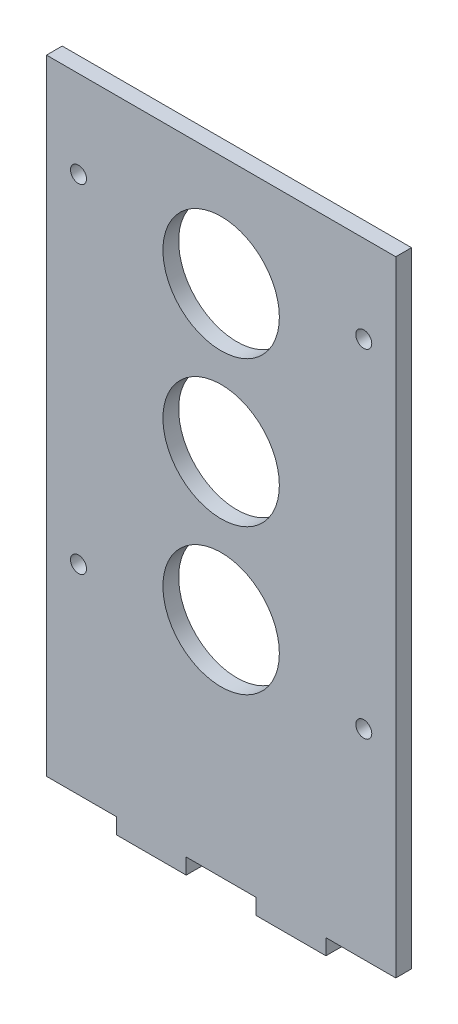
ISO-10303-21;
HEADER;
FILE_DESCRIPTION(('STEP AP214'),'2;1');
FILE_NAME('part.step','',(''),(''),'','','');
FILE_SCHEMA(('AUTOMOTIVE_DESIGN { 1 0 10303 214 1 1 1 1 }'));
ENDSEC;
DATA;
#1=APPLICATION_CONTEXT('core data for automotive mechanical design processes');
#2=APPLICATION_PROTOCOL_DEFINITION('international standard','automotive_design',2000,#1);
#3=PRODUCT_CONTEXT('',#1,'mechanical');
#4=PRODUCT('Part','Part','',(#3));
#5=PRODUCT_RELATED_PRODUCT_CATEGORY('part','',(#4));
#6=PRODUCT_DEFINITION_FORMATION('','',#4);
#7=PRODUCT_DEFINITION_CONTEXT('part definition',#1,'design');
#8=PRODUCT_DEFINITION('design','',#6,#7);
#9=PRODUCT_DEFINITION_SHAPE('','',#8);
#10=(LENGTH_UNIT() NAMED_UNIT(*) SI_UNIT(.MILLI.,.METRE.));
#11=(NAMED_UNIT(*) PLANE_ANGLE_UNIT() SI_UNIT($,.RADIAN.));
#12=(NAMED_UNIT(*) SI_UNIT($,.STERADIAN.) SOLID_ANGLE_UNIT());
#13=UNCERTAINTY_MEASURE_WITH_UNIT(LENGTH_MEASURE(1.E-05),#10,'distance_accuracy_value','');
#14=(GEOMETRIC_REPRESENTATION_CONTEXT(3) GLOBAL_UNCERTAINTY_ASSIGNED_CONTEXT((#13)) GLOBAL_UNIT_ASSIGNED_CONTEXT((#10,
#11,#12)) REPRESENTATION_CONTEXT('',''));
#15=CARTESIAN_POINT('',(0.,0.,0.));
#16=DIRECTION('',(0.,0.,1.));
#17=DIRECTION('',(1.,0.,0.));
#18=AXIS2_PLACEMENT_3D('',#15,#16,#17);
#19=CARTESIAN_POINT('',(0.,0.,2.7));
#20=DIRECTION('',(0.,0.,-1.));
#21=DIRECTION('',(-1.,0.,0.));
#22=AXIS2_PLACEMENT_3D('',#19,#20,#21);
#23=PLANE('',#22);
#24=DIRECTION('',(0.,-1.,0.));
#25=VECTOR('',#24,1.);
#26=CARTESIAN_POINT('',(-30.,50.,2.7));
#27=LINE('',#26,#25);
#28=CARTESIAN_POINT('',(-30.,60.,2.7));
#29=VERTEX_POINT('',#28);
#30=CARTESIAN_POINT('',(-30.,-47.3,2.7));
#31=VERTEX_POINT('',#30);
#32=EDGE_CURVE('E103',#29,#31,#27,.T.);
#33=ORIENTED_EDGE('',*,*,#32,.T.);
#34=DIRECTION('',(1.,0.,0.));
#35=VECTOR('',#34,1.);
#36=CARTESIAN_POINT('',(-18.,-47.3,2.7));
#37=LINE('',#36,#35);
#38=CARTESIAN_POINT('',(-18.,-47.3,2.7));
#39=VERTEX_POINT('',#38);
#40=EDGE_CURVE('E245',#31,#39,#37,.T.);
#41=ORIENTED_EDGE('',*,*,#40,.T.);
#42=DIRECTION('',(0.,-1.,0.));
#43=VECTOR('',#42,1.);
#44=CARTESIAN_POINT('',(-18.,-50.,2.7));
#45=LINE('',#44,#43);
#46=CARTESIAN_POINT('',(-18.,-50.,2.7));
#47=VERTEX_POINT('',#46);
#48=EDGE_CURVE('E204',#39,#47,#45,.T.);
#49=ORIENTED_EDGE('',*,*,#48,.T.);
#50=DIRECTION('',(1.,0.,0.));
#51=VECTOR('',#50,1.);
#52=CARTESIAN_POINT('',(-6.,-50.,2.7));
#53=LINE('',#52,#51);
#54=CARTESIAN_POINT('',(-6.,-50.,2.7));
#55=VERTEX_POINT('',#54);
#56=EDGE_CURVE('E223',#47,#55,#53,.T.);
#57=ORIENTED_EDGE('',*,*,#56,.T.);
#58=DIRECTION('',(0.,1.,0.));
#59=VECTOR('',#58,1.);
#60=CARTESIAN_POINT('',(-6.,-50.,2.7));
#61=LINE('',#60,#59);
#62=CARTESIAN_POINT('',(-6.,-47.3,2.7));
#63=VERTEX_POINT('',#62);
#64=EDGE_CURVE('E220',#55,#63,#61,.T.);
#65=ORIENTED_EDGE('',*,*,#64,.T.);
#66=DIRECTION('',(1.,0.,0.));
#67=VECTOR('',#66,1.);
#68=CARTESIAN_POINT('',(-6.,-47.3,2.7));
#69=LINE('',#68,#67);
#70=CARTESIAN_POINT('',(6.00000000000001,-47.3,2.7));
#71=VERTEX_POINT('',#70);
#72=EDGE_CURVE('E222',#63,#71,#69,.T.);
#73=ORIENTED_EDGE('',*,*,#72,.T.);
#74=DIRECTION('',(0.,-1.,0.));
#75=VECTOR('',#74,1.);
#76=CARTESIAN_POINT('',(6.00000000000001,-50.,2.7));
#77=LINE('',#76,#75);
#78=CARTESIAN_POINT('',(6.00000000000001,-50.,2.7));
#79=VERTEX_POINT('',#78);
#80=EDGE_CURVE('E225',#71,#79,#77,.T.);
#81=ORIENTED_EDGE('',*,*,#80,.T.);
#82=DIRECTION('',(1.,0.,0.));
#83=VECTOR('',#82,1.);
#84=CARTESIAN_POINT('',(18.,-50.,2.7));
#85=LINE('',#84,#83);
#86=CARTESIAN_POINT('',(18.,-50.,2.7));
#87=VERTEX_POINT('',#86);
#88=EDGE_CURVE('E231',#79,#87,#85,.T.);
#89=ORIENTED_EDGE('',*,*,#88,.T.);
#90=DIRECTION('',(0.,1.,0.));
#91=VECTOR('',#90,1.);
#92=CARTESIAN_POINT('',(18.,-50.,2.7));
#93=LINE('',#92,#91);
#94=CARTESIAN_POINT('',(18.,-47.3,2.7));
#95=VERTEX_POINT('',#94);
#96=EDGE_CURVE('E135',#87,#95,#93,.T.);
#97=ORIENTED_EDGE('',*,*,#96,.T.);
#98=DIRECTION('',(1.,0.,0.));
#99=VECTOR('',#98,1.);
#100=CARTESIAN_POINT('',(18.,-47.3,2.7));
#101=LINE('',#100,#99);
#102=CARTESIAN_POINT('',(30.,-47.3,2.7));
#103=VERTEX_POINT('',#102);
#104=EDGE_CURVE('E129',#95,#103,#101,.T.);
#105=ORIENTED_EDGE('',*,*,#104,.T.);
#106=DIRECTION('',(0.,1.,0.));
#107=VECTOR('',#106,1.);
#108=CARTESIAN_POINT('',(30.,-47.3,2.7));
#109=LINE('',#108,#107);
#110=CARTESIAN_POINT('',(30.,60.,2.7));
#111=VERTEX_POINT('',#110);
#112=EDGE_CURVE('E133',#103,#111,#109,.T.);
#113=ORIENTED_EDGE('',*,*,#112,.T.);
#114=DIRECTION('',(-1.,0.,0.));
#115=VECTOR('',#114,1.);
#116=CARTESIAN_POINT('',(-30.,60.,2.7));
#117=LINE('',#116,#115);
#118=EDGE_CURVE('E50',#111,#29,#117,.T.);
#119=ORIENTED_EDGE('',*,*,#118,.T.);
#120=EDGE_LOOP('',(#33,#41,#49,#57,#65,#73,#81,#89,#97,#105,#113,#119));
#121=FACE_BOUND('',#120,.T.);
#122=CARTESIAN_POINT('',(0.,16.,2.7));
#123=DIRECTION('',(0.,0.,1.));
#124=DIRECTION('',(1.,0.,0.));
#125=AXIS2_PLACEMENT_3D('',#122,#123,#124);
#126=CIRCLE('',#125,10.);
#127=CARTESIAN_POINT('',(10.,16.,2.7));
#128=VERTEX_POINT('',#127);
#129=EDGE_CURVE('E156',#128,#128,#126,.T.);
#130=ORIENTED_EDGE('',*,*,#129,.F.);
#131=EDGE_LOOP('',(#130));
#132=FACE_BOUND('',#131,.T.);
#133=CARTESIAN_POINT('',(-24.5,45.,2.7));
#134=DIRECTION('',(0.,0.,1.));
#135=DIRECTION('',(1.,0.,0.));
#136=AXIS2_PLACEMENT_3D('',#133,#134,#135);
#137=CIRCLE('',#136,1.375);
#138=CARTESIAN_POINT('',(-23.125,45.,2.7));
#139=VERTEX_POINT('',#138);
#140=EDGE_CURVE('E479',#139,#139,#137,.T.);
#141=ORIENTED_EDGE('',*,*,#140,.F.);
#142=EDGE_LOOP('',(#141));
#143=FACE_BOUND('',#142,.T.);
#144=CARTESIAN_POINT('',(24.5,45.,2.7));
#145=DIRECTION('',(0.,0.,1.));
#146=DIRECTION('',(1.,0.,0.));
#147=AXIS2_PLACEMENT_3D('',#144,#145,#146);
#148=CIRCLE('',#147,1.375);
#149=CARTESIAN_POINT('',(25.875,45.,2.7));
#150=VERTEX_POINT('',#149);
#151=EDGE_CURVE('E473',#150,#150,#148,.T.);
#152=ORIENTED_EDGE('',*,*,#151,.F.);
#153=EDGE_LOOP('',(#152));
#154=FACE_BOUND('',#153,.T.);
#155=CARTESIAN_POINT('',(-24.5,-13.,2.7));
#156=DIRECTION('',(0.,0.,1.));
#157=DIRECTION('',(1.,0.,0.));
#158=AXIS2_PLACEMENT_3D('',#155,#156,#157);
#159=CIRCLE('',#158,1.375);
#160=CARTESIAN_POINT('',(-23.125,-13.,2.7));
#161=VERTEX_POINT('',#160);
#162=EDGE_CURVE('E467',#161,#161,#159,.T.);
#163=ORIENTED_EDGE('',*,*,#162,.F.);
#164=EDGE_LOOP('',(#163));
#165=FACE_BOUND('',#164,.T.);
#166=CARTESIAN_POINT('',(24.5,-13.,2.7));
#167=DIRECTION('',(0.,0.,1.));
#168=DIRECTION('',(1.,0.,0.));
#169=AXIS2_PLACEMENT_3D('',#166,#167,#168);
#170=CIRCLE('',#169,1.375);
#171=CARTESIAN_POINT('',(25.875,-13.,2.7));
#172=VERTEX_POINT('',#171);
#173=EDGE_CURVE('E461',#172,#172,#170,.T.);
#174=ORIENTED_EDGE('',*,*,#173,.F.);
#175=EDGE_LOOP('',(#174));
#176=FACE_BOUND('',#175,.T.);
#177=CARTESIAN_POINT('',(0.,41.,2.7));
#178=DIRECTION('',(0.,0.,1.));
#179=DIRECTION('',(1.,0.,0.));
#180=AXIS2_PLACEMENT_3D('',#177,#178,#179);
#181=CIRCLE('',#180,10.);
#182=CARTESIAN_POINT('',(10.,41.,2.7));
#183=VERTEX_POINT('',#182);
#184=EDGE_CURVE('E455',#183,#183,#181,.T.);
#185=ORIENTED_EDGE('',*,*,#184,.F.);
#186=EDGE_LOOP('',(#185));
#187=FACE_BOUND('',#186,.T.);
#188=CARTESIAN_POINT('',(0.,-8.99999999999998,2.7));
#189=DIRECTION('',(0.,0.,1.));
#190=DIRECTION('',(1.,0.,0.));
#191=AXIS2_PLACEMENT_3D('',#188,#189,#190);
#192=CIRCLE('',#191,10.);
#193=CARTESIAN_POINT('',(10.,-8.99999999999998,2.7));
#194=VERTEX_POINT('',#193);
#195=EDGE_CURVE('E446',#194,#194,#192,.T.);
#196=ORIENTED_EDGE('',*,*,#195,.F.);
#197=EDGE_LOOP('',(#196));
#198=FACE_BOUND('',#197,.T.);
#199=ADVANCED_FACE('F33',(#121,#132,#143,#154,#165,#176,#187,#198),#23,.F.);
#200=CARTESIAN_POINT('',(0.,0.,0.));
#201=DIRECTION('',(0.,0.,-1.));
#202=DIRECTION('',(-1.,0.,0.));
#203=AXIS2_PLACEMENT_3D('',#200,#201,#202);
#204=PLANE('',#203);
#205=CARTESIAN_POINT('',(0.,41.,0.));
#206=DIRECTION('',(0.,0.,1.));
#207=DIRECTION('',(1.,0.,0.));
#208=AXIS2_PLACEMENT_3D('',#205,#206,#207);
#209=CIRCLE('',#208,10.);
#210=CARTESIAN_POINT('',(10.,41.,0.));
#211=VERTEX_POINT('',#210);
#212=EDGE_CURVE('E452',#211,#211,#209,.T.);
#213=ORIENTED_EDGE('',*,*,#212,.T.);
#214=EDGE_LOOP('',(#213));
#215=FACE_BOUND('',#214,.T.);
#216=CARTESIAN_POINT('',(-24.5,-13.,0.));
#217=DIRECTION('',(0.,0.,1.));
#218=DIRECTION('',(1.,0.,0.));
#219=AXIS2_PLACEMENT_3D('',#216,#217,#218);
#220=CIRCLE('',#219,1.375);
#221=CARTESIAN_POINT('',(-23.125,-13.,0.));
#222=VERTEX_POINT('',#221);
#223=EDGE_CURVE('E464',#222,#222,#220,.T.);
#224=ORIENTED_EDGE('',*,*,#223,.T.);
#225=EDGE_LOOP('',(#224));
#226=FACE_BOUND('',#225,.T.);
#227=CARTESIAN_POINT('',(-24.5,45.,0.));
#228=DIRECTION('',(0.,0.,1.));
#229=DIRECTION('',(1.,0.,0.));
#230=AXIS2_PLACEMENT_3D('',#227,#228,#229);
#231=CIRCLE('',#230,1.375);
#232=CARTESIAN_POINT('',(-23.125,45.,0.));
#233=VERTEX_POINT('',#232);
#234=EDGE_CURVE('E476',#233,#233,#231,.T.);
#235=ORIENTED_EDGE('',*,*,#234,.T.);
#236=EDGE_LOOP('',(#235));
#237=FACE_BOUND('',#236,.T.);
#238=DIRECTION('',(0.,-1.,0.));
#239=VECTOR('',#238,1.);
#240=CARTESIAN_POINT('',(-30.,-47.3,0.));
#241=LINE('',#240,#239);
#242=CARTESIAN_POINT('',(-30.,60.,0.));
#243=VERTEX_POINT('',#242);
#244=CARTESIAN_POINT('',(-30.,-47.3,0.));
#245=VERTEX_POINT('',#244);
#246=EDGE_CURVE('E97',#243,#245,#241,.T.);
#247=ORIENTED_EDGE('',*,*,#246,.F.);
#248=DIRECTION('',(-1.,0.,0.));
#249=VECTOR('',#248,1.);
#250=CARTESIAN_POINT('',(-30.,60.,0.));
#251=LINE('',#250,#249);
#252=CARTESIAN_POINT('',(30.,60.,0.));
#253=VERTEX_POINT('',#252);
#254=EDGE_CURVE('E174',#253,#243,#251,.T.);
#255=ORIENTED_EDGE('',*,*,#254,.F.);
#256=DIRECTION('',(0.,1.,0.));
#257=VECTOR('',#256,1.);
#258=CARTESIAN_POINT('',(30.,60.,0.));
#259=LINE('',#258,#257);
#260=CARTESIAN_POINT('',(30.,-47.3,0.));
#261=VERTEX_POINT('',#260);
#262=EDGE_CURVE('E90',#261,#253,#259,.T.);
#263=ORIENTED_EDGE('',*,*,#262,.F.);
#264=DIRECTION('',(1.,0.,0.));
#265=VECTOR('',#264,1.);
#266=CARTESIAN_POINT('',(18.,-47.3,0.));
#267=LINE('',#266,#265);
#268=CARTESIAN_POINT('',(18.,-47.3,0.));
#269=VERTEX_POINT('',#268);
#270=EDGE_CURVE('E144',#269,#261,#267,.T.);
#271=ORIENTED_EDGE('',*,*,#270,.F.);
#272=DIRECTION('',(0.,1.,0.));
#273=VECTOR('',#272,1.);
#274=CARTESIAN_POINT('',(18.,-50.,0.));
#275=LINE('',#274,#273);
#276=CARTESIAN_POINT('',(18.,-50.,0.));
#277=VERTEX_POINT('',#276);
#278=EDGE_CURVE('E170',#277,#269,#275,.T.);
#279=ORIENTED_EDGE('',*,*,#278,.F.);
#280=DIRECTION('',(1.,0.,0.));
#281=VECTOR('',#280,1.);
#282=CARTESIAN_POINT('',(18.,-50.,0.));
#283=LINE('',#282,#281);
#284=CARTESIAN_POINT('',(6.00000000000001,-50.,0.));
#285=VERTEX_POINT('',#284);
#286=EDGE_CURVE('E168',#285,#277,#283,.T.);
#287=ORIENTED_EDGE('',*,*,#286,.F.);
#288=DIRECTION('',(0.,-1.,0.));
#289=VECTOR('',#288,1.);
#290=CARTESIAN_POINT('',(6.00000000000001,-50.,0.));
#291=LINE('',#290,#289);
#292=CARTESIAN_POINT('',(6.00000000000001,-47.3,0.));
#293=VERTEX_POINT('',#292);
#294=EDGE_CURVE('E166',#293,#285,#291,.T.);
#295=ORIENTED_EDGE('',*,*,#294,.F.);
#296=DIRECTION('',(1.,0.,0.));
#297=VECTOR('',#296,1.);
#298=CARTESIAN_POINT('',(-6.,-47.3,0.));
#299=LINE('',#298,#297);
#300=CARTESIAN_POINT('',(-6.,-47.3,0.));
#301=VERTEX_POINT('',#300);
#302=EDGE_CURVE('E164',#301,#293,#299,.T.);
#303=ORIENTED_EDGE('',*,*,#302,.F.);
#304=DIRECTION('',(0.,1.,0.));
#305=VECTOR('',#304,1.);
#306=CARTESIAN_POINT('',(-6.,-50.,0.));
#307=LINE('',#306,#305);
#308=CARTESIAN_POINT('',(-6.,-50.,0.));
#309=VERTEX_POINT('',#308);
#310=EDGE_CURVE('E162',#309,#301,#307,.T.);
#311=ORIENTED_EDGE('',*,*,#310,.F.);
#312=DIRECTION('',(1.,0.,0.));
#313=VECTOR('',#312,1.);
#314=CARTESIAN_POINT('',(-6.,-50.,0.));
#315=LINE('',#314,#313);
#316=CARTESIAN_POINT('',(-18.,-50.,0.));
#317=VERTEX_POINT('',#316);
#318=EDGE_CURVE('E160',#317,#309,#315,.T.);
#319=ORIENTED_EDGE('',*,*,#318,.F.);
#320=DIRECTION('',(0.,-1.,0.));
#321=VECTOR('',#320,1.);
#322=CARTESIAN_POINT('',(-18.,-50.,0.));
#323=LINE('',#322,#321);
#324=CARTESIAN_POINT('',(-18.,-47.3,0.));
#325=VERTEX_POINT('',#324);
#326=EDGE_CURVE('E158',#325,#317,#323,.T.);
#327=ORIENTED_EDGE('',*,*,#326,.F.);
#328=DIRECTION('',(1.,0.,0.));
#329=VECTOR('',#328,1.);
#330=CARTESIAN_POINT('',(-18.,-47.3,0.));
#331=LINE('',#330,#329);
#332=EDGE_CURVE('E155',#245,#325,#331,.T.);
#333=ORIENTED_EDGE('',*,*,#332,.F.);
#334=EDGE_LOOP('',(#247,#255,#263,#271,#279,#287,#295,#303,#311,#319,#327,#333));
#335=FACE_BOUND('',#334,.T.);
#336=CARTESIAN_POINT('',(0.,16.,0.));
#337=DIRECTION('',(0.,0.,1.));
#338=DIRECTION('',(1.,0.,0.));
#339=AXIS2_PLACEMENT_3D('',#336,#337,#338);
#340=CIRCLE('',#339,10.);
#341=CARTESIAN_POINT('',(10.,16.,0.));
#342=VERTEX_POINT('',#341);
#343=EDGE_CURVE('E249',#342,#342,#340,.T.);
#344=ORIENTED_EDGE('',*,*,#343,.T.);
#345=EDGE_LOOP('',(#344));
#346=FACE_BOUND('',#345,.T.);
#347=CARTESIAN_POINT('',(24.5,45.,0.));
#348=DIRECTION('',(0.,0.,1.));
#349=DIRECTION('',(1.,0.,0.));
#350=AXIS2_PLACEMENT_3D('',#347,#348,#349);
#351=CIRCLE('',#350,1.375);
#352=CARTESIAN_POINT('',(25.875,45.,0.));
#353=VERTEX_POINT('',#352);
#354=EDGE_CURVE('E470',#353,#353,#351,.T.);
#355=ORIENTED_EDGE('',*,*,#354,.T.);
#356=EDGE_LOOP('',(#355));
#357=FACE_BOUND('',#356,.T.);
#358=CARTESIAN_POINT('',(24.5,-13.,0.));
#359=DIRECTION('',(0.,0.,1.));
#360=DIRECTION('',(1.,0.,0.));
#361=AXIS2_PLACEMENT_3D('',#358,#359,#360);
#362=CIRCLE('',#361,1.375);
#363=CARTESIAN_POINT('',(25.875,-13.,0.));
#364=VERTEX_POINT('',#363);
#365=EDGE_CURVE('E458',#364,#364,#362,.T.);
#366=ORIENTED_EDGE('',*,*,#365,.T.);
#367=EDGE_LOOP('',(#366));
#368=FACE_BOUND('',#367,.T.);
#369=CARTESIAN_POINT('',(0.,-8.99999999999998,0.));
#370=DIRECTION('',(0.,0.,1.));
#371=DIRECTION('',(1.,0.,0.));
#372=AXIS2_PLACEMENT_3D('',#369,#370,#371);
#373=CIRCLE('',#372,10.);
#374=CARTESIAN_POINT('',(10.,-8.99999999999998,0.));
#375=VERTEX_POINT('',#374);
#376=EDGE_CURVE('E449',#375,#375,#373,.T.);
#377=ORIENTED_EDGE('',*,*,#376,.T.);
#378=EDGE_LOOP('',(#377));
#379=FACE_BOUND('',#378,.T.);
#380=ADVANCED_FACE('F208',(#215,#226,#237,#335,#346,#357,#368,#379),#204,.T.);
#381=CARTESIAN_POINT('',(-30.,-47.3,2.7));
#382=DIRECTION('',(1.,0.,0.));
#383=DIRECTION('',(0.,0.,-1.));
#384=AXIS2_PLACEMENT_3D('',#381,#382,#383);
#385=PLANE('',#384);
#386=ORIENTED_EDGE('',*,*,#246,.T.);
#387=DIRECTION('',(0.,0.,-1.));
#388=VECTOR('',#387,1.);
#389=CARTESIAN_POINT('',(-30.,-47.3,2.7));
#390=LINE('',#389,#388);
#391=EDGE_CURVE('E11',#31,#245,#390,.T.);
#392=ORIENTED_EDGE('',*,*,#391,.F.);
#393=ORIENTED_EDGE('',*,*,#32,.F.);
#394=DIRECTION('',(0.,0.,-1.));
#395=VECTOR('',#394,1.);
#396=CARTESIAN_POINT('',(-30.,60.,2.7));
#397=LINE('',#396,#395);
#398=EDGE_CURVE('E150',#29,#243,#397,.T.);
#399=ORIENTED_EDGE('',*,*,#398,.T.);
#400=EDGE_LOOP('',(#386,#392,#393,#399));
#401=FACE_BOUND('',#400,.T.);
#402=ADVANCED_FACE('F35',(#401),#385,.F.);
#403=CARTESIAN_POINT('',(-18.,-47.3,2.7));
#404=DIRECTION('',(0.,1.,0.));
#405=DIRECTION('',(0.,0.,1.));
#406=AXIS2_PLACEMENT_3D('',#403,#404,#405);
#407=PLANE('',#406);
#408=ORIENTED_EDGE('',*,*,#332,.T.);
#409=DIRECTION('',(0.,0.,-1.));
#410=VECTOR('',#409,1.);
#411=CARTESIAN_POINT('',(-18.,-47.3,2.7));
#412=LINE('',#411,#410);
#413=EDGE_CURVE('E42',#39,#325,#412,.T.);
#414=ORIENTED_EDGE('',*,*,#413,.F.);
#415=ORIENTED_EDGE('',*,*,#40,.F.);
#416=ORIENTED_EDGE('',*,*,#391,.T.);
#417=EDGE_LOOP('',(#408,#414,#415,#416));
#418=FACE_BOUND('',#417,.T.);
#419=ADVANCED_FACE('F251',(#418),#407,.F.);
#420=CARTESIAN_POINT('',(-18.,-50.,2.7));
#421=DIRECTION('',(1.,0.,0.));
#422=DIRECTION('',(0.,0.,-1.));
#423=AXIS2_PLACEMENT_3D('',#420,#421,#422);
#424=PLANE('',#423);
#425=ORIENTED_EDGE('',*,*,#326,.T.);
#426=DIRECTION('',(0.,0.,-1.));
#427=VECTOR('',#426,1.);
#428=CARTESIAN_POINT('',(-18.,-50.,2.7));
#429=LINE('',#428,#427);
#430=EDGE_CURVE('E195',#47,#317,#429,.T.);
#431=ORIENTED_EDGE('',*,*,#430,.F.);
#432=ORIENTED_EDGE('',*,*,#48,.F.);
#433=ORIENTED_EDGE('',*,*,#413,.T.);
#434=EDGE_LOOP('',(#425,#431,#432,#433));
#435=FACE_BOUND('',#434,.T.);
#436=ADVANCED_FACE('F202',(#435),#424,.F.);
#437=CARTESIAN_POINT('',(-6.,-50.,2.7));
#438=DIRECTION('',(0.,1.,0.));
#439=DIRECTION('',(0.,0.,1.));
#440=AXIS2_PLACEMENT_3D('',#437,#438,#439);
#441=PLANE('',#440);
#442=ORIENTED_EDGE('',*,*,#318,.T.);
#443=DIRECTION('',(0.,0.,-1.));
#444=VECTOR('',#443,1.);
#445=CARTESIAN_POINT('',(-6.,-50.,2.7));
#446=LINE('',#445,#444);
#447=EDGE_CURVE('E192',#55,#309,#446,.T.);
#448=ORIENTED_EDGE('',*,*,#447,.F.);
#449=ORIENTED_EDGE('',*,*,#56,.F.);
#450=ORIENTED_EDGE('',*,*,#430,.T.);
#451=EDGE_LOOP('',(#442,#448,#449,#450));
#452=FACE_BOUND('',#451,.T.);
#453=ADVANCED_FACE('F214',(#452),#441,.F.);
#454=CARTESIAN_POINT('',(-6.,-50.,2.7));
#455=DIRECTION('',(-1.,0.,0.));
#456=DIRECTION('',(0.,0.,1.));
#457=AXIS2_PLACEMENT_3D('',#454,#455,#456);
#458=PLANE('',#457);
#459=ORIENTED_EDGE('',*,*,#310,.T.);
#460=DIRECTION('',(0.,0.,-1.));
#461=VECTOR('',#460,1.);
#462=CARTESIAN_POINT('',(-6.,-47.3,2.7));
#463=LINE('',#462,#461);
#464=EDGE_CURVE('E189',#63,#301,#463,.T.);
#465=ORIENTED_EDGE('',*,*,#464,.F.);
#466=ORIENTED_EDGE('',*,*,#64,.F.);
#467=ORIENTED_EDGE('',*,*,#447,.T.);
#468=EDGE_LOOP('',(#459,#465,#466,#467));
#469=FACE_BOUND('',#468,.T.);
#470=ADVANCED_FACE('F218',(#469),#458,.F.);
#471=CARTESIAN_POINT('',(-6.,-47.3,2.7));
#472=DIRECTION('',(0.,1.,0.));
#473=DIRECTION('',(0.,0.,1.));
#474=AXIS2_PLACEMENT_3D('',#471,#472,#473);
#475=PLANE('',#474);
#476=ORIENTED_EDGE('',*,*,#302,.T.);
#477=DIRECTION('',(0.,0.,-1.));
#478=VECTOR('',#477,1.);
#479=CARTESIAN_POINT('',(6.00000000000001,-47.3,2.7));
#480=LINE('',#479,#478);
#481=EDGE_CURVE('E186',#71,#293,#480,.T.);
#482=ORIENTED_EDGE('',*,*,#481,.F.);
#483=ORIENTED_EDGE('',*,*,#72,.F.);
#484=ORIENTED_EDGE('',*,*,#464,.T.);
#485=EDGE_LOOP('',(#476,#482,#483,#484));
#486=FACE_BOUND('',#485,.T.);
#487=ADVANCED_FACE('F282',(#486),#475,.F.);
#488=CARTESIAN_POINT('',(6.00000000000001,-50.,2.7));
#489=DIRECTION('',(1.,0.,0.));
#490=DIRECTION('',(0.,0.,-1.));
#491=AXIS2_PLACEMENT_3D('',#488,#489,#490);
#492=PLANE('',#491);
#493=ORIENTED_EDGE('',*,*,#294,.T.);
#494=DIRECTION('',(0.,0.,-1.));
#495=VECTOR('',#494,1.);
#496=CARTESIAN_POINT('',(6.00000000000001,-50.,2.7));
#497=LINE('',#496,#495);
#498=EDGE_CURVE('E183',#79,#285,#497,.T.);
#499=ORIENTED_EDGE('',*,*,#498,.F.);
#500=ORIENTED_EDGE('',*,*,#80,.F.);
#501=ORIENTED_EDGE('',*,*,#481,.T.);
#502=EDGE_LOOP('',(#493,#499,#500,#501));
#503=FACE_BOUND('',#502,.T.);
#504=ADVANCED_FACE('F279',(#503),#492,.F.);
#505=CARTESIAN_POINT('',(18.,-50.,2.7));
#506=DIRECTION('',(0.,1.,0.));
#507=DIRECTION('',(0.,0.,1.));
#508=AXIS2_PLACEMENT_3D('',#505,#506,#507);
#509=PLANE('',#508);
#510=ORIENTED_EDGE('',*,*,#286,.T.);
#511=DIRECTION('',(0.,0.,-1.));
#512=VECTOR('',#511,1.);
#513=CARTESIAN_POINT('',(18.,-50.,2.7));
#514=LINE('',#513,#512);
#515=EDGE_CURVE('E180',#87,#277,#514,.T.);
#516=ORIENTED_EDGE('',*,*,#515,.F.);
#517=ORIENTED_EDGE('',*,*,#88,.F.);
#518=ORIENTED_EDGE('',*,*,#498,.T.);
#519=EDGE_LOOP('',(#510,#516,#517,#518));
#520=FACE_BOUND('',#519,.T.);
#521=ADVANCED_FACE('F237',(#520),#509,.F.);
#522=CARTESIAN_POINT('',(18.,-50.,2.7));
#523=DIRECTION('',(-1.,0.,0.));
#524=DIRECTION('',(0.,0.,1.));
#525=AXIS2_PLACEMENT_3D('',#522,#523,#524);
#526=PLANE('',#525);
#527=ORIENTED_EDGE('',*,*,#278,.T.);
#528=DIRECTION('',(0.,0.,-1.));
#529=VECTOR('',#528,1.);
#530=CARTESIAN_POINT('',(18.,-47.3,2.7));
#531=LINE('',#530,#529);
#532=EDGE_CURVE('E145',#95,#269,#531,.T.);
#533=ORIENTED_EDGE('',*,*,#532,.F.);
#534=ORIENTED_EDGE('',*,*,#96,.F.);
#535=ORIENTED_EDGE('',*,*,#515,.T.);
#536=EDGE_LOOP('',(#527,#533,#534,#535));
#537=FACE_BOUND('',#536,.T.);
#538=ADVANCED_FACE('F241',(#537),#526,.F.);
#539=CARTESIAN_POINT('',(18.,-47.3,2.7));
#540=DIRECTION('',(0.,1.,0.));
#541=DIRECTION('',(0.,0.,1.));
#542=AXIS2_PLACEMENT_3D('',#539,#540,#541);
#543=PLANE('',#542);
#544=ORIENTED_EDGE('',*,*,#270,.T.);
#545=DIRECTION('',(0.,0.,-1.));
#546=VECTOR('',#545,1.);
#547=CARTESIAN_POINT('',(30.,-47.3,2.7));
#548=LINE('',#547,#546);
#549=EDGE_CURVE('E141',#103,#261,#548,.T.);
#550=ORIENTED_EDGE('',*,*,#549,.F.);
#551=ORIENTED_EDGE('',*,*,#104,.F.);
#552=ORIENTED_EDGE('',*,*,#532,.T.);
#553=EDGE_LOOP('',(#544,#550,#551,#552));
#554=FACE_BOUND('',#553,.T.);
#555=ADVANCED_FACE('F142',(#554),#543,.F.);
#556=CARTESIAN_POINT('',(30.,60.,2.7));
#557=DIRECTION('',(-1.,0.,0.));
#558=DIRECTION('',(0.,0.,1.));
#559=AXIS2_PLACEMENT_3D('',#556,#557,#558);
#560=PLANE('',#559);
#561=ORIENTED_EDGE('',*,*,#262,.T.);
#562=DIRECTION('',(0.,0.,-1.));
#563=VECTOR('',#562,1.);
#564=CARTESIAN_POINT('',(30.,60.,2.7));
#565=LINE('',#564,#563);
#566=EDGE_CURVE('E146',#111,#253,#565,.T.);
#567=ORIENTED_EDGE('',*,*,#566,.F.);
#568=ORIENTED_EDGE('',*,*,#112,.F.);
#569=ORIENTED_EDGE('',*,*,#549,.T.);
#570=EDGE_LOOP('',(#561,#567,#568,#569));
#571=FACE_BOUND('',#570,.T.);
#572=ADVANCED_FACE('F148',(#571),#560,.F.);
#573=CARTESIAN_POINT('',(-30.,60.,2.7));
#574=DIRECTION('',(0.,-1.,0.));
#575=DIRECTION('',(0.,0.,-1.));
#576=AXIS2_PLACEMENT_3D('',#573,#574,#575);
#577=PLANE('',#576);
#578=ORIENTED_EDGE('',*,*,#254,.T.);
#579=ORIENTED_EDGE('',*,*,#398,.F.);
#580=ORIENTED_EDGE('',*,*,#118,.F.);
#581=ORIENTED_EDGE('',*,*,#566,.T.);
#582=EDGE_LOOP('',(#578,#579,#580,#581));
#583=FACE_BOUND('',#582,.T.);
#584=ADVANCED_FACE('F243',(#583),#577,.F.);
#585=CARTESIAN_POINT('',(0.,16.,2.7));
#586=DIRECTION('',(0.,0.,-1.));
#587=DIRECTION('',(-1.,0.,0.));
#588=AXIS2_PLACEMENT_3D('',#585,#586,#587);
#589=CYLINDRICAL_SURFACE('',#588,10.);
#590=ORIENTED_EDGE('',*,*,#129,.T.);
#591=EDGE_LOOP('',(#590));
#592=FACE_BOUND('',#591,.T.);
#593=ORIENTED_EDGE('',*,*,#343,.F.);
#594=EDGE_LOOP('',(#593));
#595=FACE_BOUND('',#594,.T.);
#596=ADVANCED_FACE('F266',(#592,#595),#589,.F.);
#597=CARTESIAN_POINT('',(-24.5,45.,2.7));
#598=DIRECTION('',(0.,0.,-1.));
#599=DIRECTION('',(-1.,0.,0.));
#600=AXIS2_PLACEMENT_3D('',#597,#598,#599);
#601=CYLINDRICAL_SURFACE('',#600,1.375);
#602=ORIENTED_EDGE('',*,*,#140,.T.);
#603=EDGE_LOOP('',(#602));
#604=FACE_BOUND('',#603,.T.);
#605=ORIENTED_EDGE('',*,*,#234,.F.);
#606=EDGE_LOOP('',(#605));
#607=FACE_BOUND('',#606,.T.);
#608=ADVANCED_FACE('F332',(#604,#607),#601,.F.);
#609=CARTESIAN_POINT('',(24.5,45.,2.7));
#610=DIRECTION('',(0.,0.,-1.));
#611=DIRECTION('',(-1.,0.,0.));
#612=AXIS2_PLACEMENT_3D('',#609,#610,#611);
#613=CYLINDRICAL_SURFACE('',#612,1.375);
#614=ORIENTED_EDGE('',*,*,#151,.T.);
#615=EDGE_LOOP('',(#614));
#616=FACE_BOUND('',#615,.T.);
#617=ORIENTED_EDGE('',*,*,#354,.F.);
#618=EDGE_LOOP('',(#617));
#619=FACE_BOUND('',#618,.T.);
#620=ADVANCED_FACE('F339',(#616,#619),#613,.F.);
#621=CARTESIAN_POINT('',(-24.5,-13.,2.7));
#622=DIRECTION('',(0.,0.,-1.));
#623=DIRECTION('',(-1.,0.,0.));
#624=AXIS2_PLACEMENT_3D('',#621,#622,#623);
#625=CYLINDRICAL_SURFACE('',#624,1.375);
#626=ORIENTED_EDGE('',*,*,#162,.T.);
#627=EDGE_LOOP('',(#626));
#628=FACE_BOUND('',#627,.T.);
#629=ORIENTED_EDGE('',*,*,#223,.F.);
#630=EDGE_LOOP('',(#629));
#631=FACE_BOUND('',#630,.T.);
#632=ADVANCED_FACE('F346',(#628,#631),#625,.F.);
#633=CARTESIAN_POINT('',(24.5,-13.,2.7));
#634=DIRECTION('',(0.,0.,-1.));
#635=DIRECTION('',(-1.,0.,0.));
#636=AXIS2_PLACEMENT_3D('',#633,#634,#635);
#637=CYLINDRICAL_SURFACE('',#636,1.375);
#638=ORIENTED_EDGE('',*,*,#173,.T.);
#639=EDGE_LOOP('',(#638));
#640=FACE_BOUND('',#639,.T.);
#641=ORIENTED_EDGE('',*,*,#365,.F.);
#642=EDGE_LOOP('',(#641));
#643=FACE_BOUND('',#642,.T.);
#644=ADVANCED_FACE('F354',(#640,#643),#637,.F.);
#645=CARTESIAN_POINT('',(0.,41.,2.7));
#646=DIRECTION('',(0.,0.,-1.));
#647=DIRECTION('',(-1.,0.,0.));
#648=AXIS2_PLACEMENT_3D('',#645,#646,#647);
#649=CYLINDRICAL_SURFACE('',#648,10.);
#650=ORIENTED_EDGE('',*,*,#184,.T.);
#651=EDGE_LOOP('',(#650));
#652=FACE_BOUND('',#651,.T.);
#653=ORIENTED_EDGE('',*,*,#212,.F.);
#654=EDGE_LOOP('',(#653));
#655=FACE_BOUND('',#654,.T.);
#656=ADVANCED_FACE('F362',(#652,#655),#649,.F.);
#657=CARTESIAN_POINT('',(0.,-8.99999999999998,2.7));
#658=DIRECTION('',(0.,0.,-1.));
#659=DIRECTION('',(-1.,0.,0.));
#660=AXIS2_PLACEMENT_3D('',#657,#658,#659);
#661=CYLINDRICAL_SURFACE('',#660,10.);
#662=ORIENTED_EDGE('',*,*,#195,.T.);
#663=EDGE_LOOP('',(#662));
#664=FACE_BOUND('',#663,.T.);
#665=ORIENTED_EDGE('',*,*,#376,.F.);
#666=EDGE_LOOP('',(#665));
#667=FACE_BOUND('',#666,.T.);
#668=ADVANCED_FACE('F370',(#664,#667),#661,.F.);
#669=CLOSED_SHELL('',(#199,#380,#402,#419,#436,#453,#470,#487,#504,#521,#538,#555,#572,#584,
#596,#608,#620,#632,#644,#656,#668));
#670=MANIFOLD_SOLID_BREP('B2',#669);
#671=ADVANCED_BREP_SHAPE_REPRESENTATION('',(#18,#670),#14);
#672=SHAPE_DEFINITION_REPRESENTATION(#9,#671);
ENDSEC;
END-ISO-10303-21;
